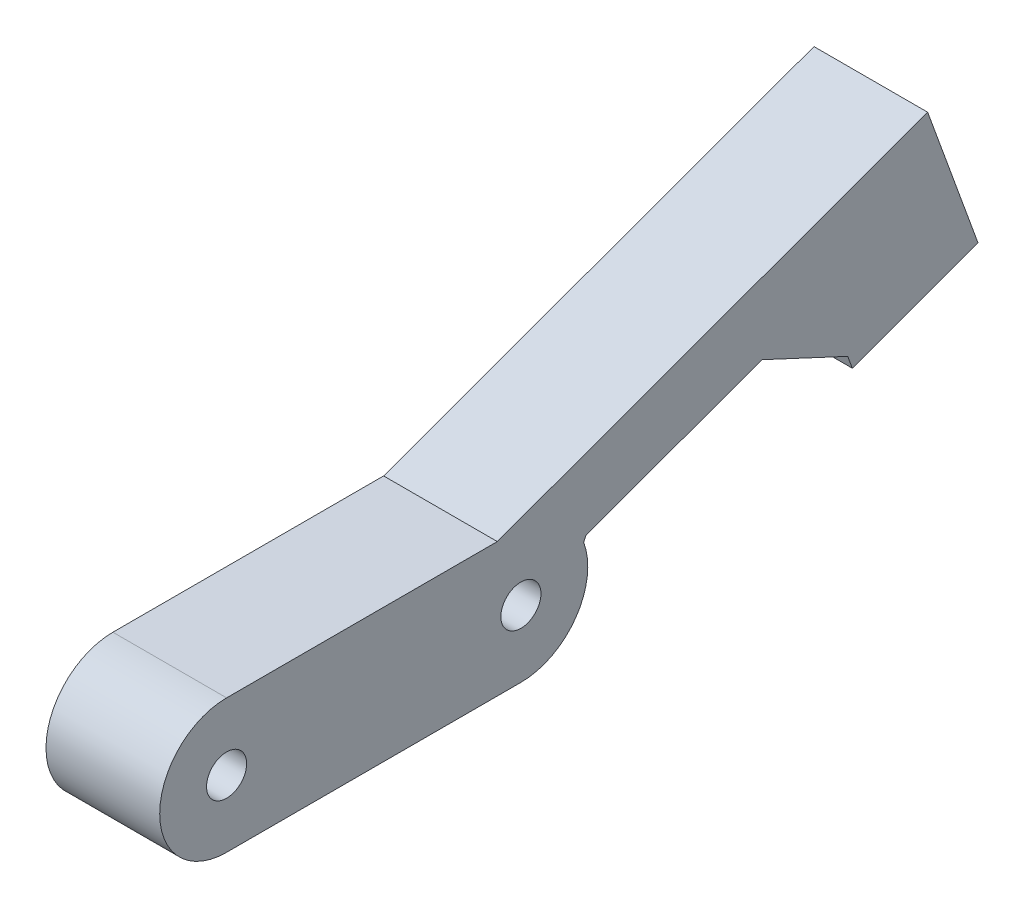
ISO-10303-21;
HEADER;
FILE_DESCRIPTION(('STEP AP214'),'2;1');
FILE_NAME('part.step','',(''),(''),'','','');
FILE_SCHEMA(('AUTOMOTIVE_DESIGN { 1 0 10303 214 1 1 1 1 }'));
ENDSEC;
DATA;
#1=APPLICATION_CONTEXT('core data for automotive mechanical design processes');
#2=APPLICATION_PROTOCOL_DEFINITION('international standard','automotive_design',2000,#1);
#3=PRODUCT_CONTEXT('',#1,'mechanical');
#4=PRODUCT('Part','Part','',(#3));
#5=PRODUCT_RELATED_PRODUCT_CATEGORY('part','',(#4));
#6=PRODUCT_DEFINITION_FORMATION('','',#4);
#7=PRODUCT_DEFINITION_CONTEXT('part definition',#1,'design');
#8=PRODUCT_DEFINITION('design','',#6,#7);
#9=PRODUCT_DEFINITION_SHAPE('','',#8);
#10=(LENGTH_UNIT() NAMED_UNIT(*) SI_UNIT(.MILLI.,.METRE.));
#11=(NAMED_UNIT(*) PLANE_ANGLE_UNIT() SI_UNIT($,.RADIAN.));
#12=(NAMED_UNIT(*) SI_UNIT($,.STERADIAN.) SOLID_ANGLE_UNIT());
#13=UNCERTAINTY_MEASURE_WITH_UNIT(LENGTH_MEASURE(1.E-05),#10,'distance_accuracy_value','');
#14=(GEOMETRIC_REPRESENTATION_CONTEXT(3) GLOBAL_UNCERTAINTY_ASSIGNED_CONTEXT((#13)) GLOBAL_UNIT_ASSIGNED_CONTEXT((#10,
#11,#12)) REPRESENTATION_CONTEXT('',''));
#15=CARTESIAN_POINT('',(0.,0.,0.));
#16=DIRECTION('',(0.,0.,1.));
#17=DIRECTION('',(1.,0.,0.));
#18=AXIS2_PLACEMENT_3D('',#15,#16,#17);
#19=CARTESIAN_POINT('',(8.5,5.,-27.));
#20=DIRECTION('',(-1.,0.,0.));
#21=DIRECTION('',(0.,0.,1.));
#22=AXIS2_PLACEMENT_3D('',#19,#20,#21);
#23=CYLINDRICAL_SURFACE('',#22,5.);
#24=DIRECTION('',(1.,0.,0.));
#25=VECTOR('',#24,1.);
#26=CARTESIAN_POINT('',(0.,6.7210191769148,-31.6944747302218));
#27=LINE('',#26,#25);
#28=CARTESIAN_POINT('',(0.,6.7210191769148,-31.6944747302218));
#29=VERTEX_POINT('',#28);
#30=CARTESIAN_POINT('',(8.5,6.7210191769148,-31.6944747302218));
#31=VERTEX_POINT('',#30);
#32=EDGE_CURVE('E187',#29,#31,#27,.T.);
#33=ORIENTED_EDGE('',*,*,#32,.T.);
#34=CARTESIAN_POINT('',(8.5,5.,-27.));
#35=DIRECTION('',(1.,0.,0.));
#36=DIRECTION('',(0.,0.,-1.));
#37=AXIS2_PLACEMENT_3D('',#34,#35,#36);
#38=CIRCLE('',#37,5.);
#39=CARTESIAN_POINT('',(8.5,0.,-27.));
#40=VERTEX_POINT('',#39);
#41=EDGE_CURVE('E205',#40,#31,#38,.T.);
#42=ORIENTED_EDGE('',*,*,#41,.F.);
#43=DIRECTION('',(-1.,0.,0.));
#44=VECTOR('',#43,1.);
#45=CARTESIAN_POINT('',(8.5,0.,-27.));
#46=LINE('',#45,#44);
#47=CARTESIAN_POINT('',(0.,0.,-27.));
#48=VERTEX_POINT('',#47);
#49=EDGE_CURVE('E213',#40,#48,#46,.T.);
#50=ORIENTED_EDGE('',*,*,#49,.T.);
#51=CARTESIAN_POINT('',(0.,5.,-27.));
#52=DIRECTION('',(1.,0.,0.));
#53=DIRECTION('',(0.,0.,-1.));
#54=AXIS2_PLACEMENT_3D('',#51,#52,#53);
#55=CIRCLE('',#54,5.);
#56=EDGE_CURVE('E217',#48,#29,#55,.T.);
#57=ORIENTED_EDGE('',*,*,#56,.T.);
#58=EDGE_LOOP('',(#33,#42,#50,#57));
#59=FACE_BOUND('',#58,.T.);
#60=ADVANCED_FACE('F37',(#59),#23,.T.);
#61=CARTESIAN_POINT('',(8.5,10.,0.));
#62=DIRECTION('',(0.,1.,0.));
#63=DIRECTION('',(0.,0.,1.));
#64=AXIS2_PLACEMENT_3D('',#61,#62,#63);
#65=PLANE('',#64);
#66=DIRECTION('',(1.,0.,0.));
#67=VECTOR('',#66,1.);
#68=CARTESIAN_POINT('',(0.,10.,-25.2367301929157));
#69=LINE('',#68,#67);
#70=CARTESIAN_POINT('',(0.,10.,-25.2367301929157));
#71=VERTEX_POINT('',#70);
#72=CARTESIAN_POINT('',(8.5,10.,-25.2367301929157));
#73=VERTEX_POINT('',#72);
#74=EDGE_CURVE('E190',#71,#73,#69,.T.);
#75=ORIENTED_EDGE('',*,*,#74,.F.);
#76=DIRECTION('',(0.,0.,-1.));
#77=VECTOR('',#76,1.);
#78=CARTESIAN_POINT('',(0.,10.,0.));
#79=LINE('',#78,#77);
#80=CARTESIAN_POINT('',(0.,10.,-5.));
#81=VERTEX_POINT('',#80);
#82=EDGE_CURVE('E186',#81,#71,#79,.T.);
#83=ORIENTED_EDGE('',*,*,#82,.F.);
#84=DIRECTION('',(-1.,0.,0.));
#85=VECTOR('',#84,1.);
#86=CARTESIAN_POINT('',(8.5,10.,-5.));
#87=LINE('',#86,#85);
#88=CARTESIAN_POINT('',(8.5,10.,-5.));
#89=VERTEX_POINT('',#88);
#90=EDGE_CURVE('E11',#89,#81,#87,.T.);
#91=ORIENTED_EDGE('',*,*,#90,.F.);
#92=DIRECTION('',(0.,0.,-1.));
#93=VECTOR('',#92,1.);
#94=CARTESIAN_POINT('',(8.5,10.,0.));
#95=LINE('',#94,#93);
#96=EDGE_CURVE('E199',#89,#73,#95,.T.);
#97=ORIENTED_EDGE('',*,*,#96,.T.);
#98=EDGE_LOOP('',(#75,#83,#91,#97));
#99=FACE_BOUND('',#98,.T.);
#100=ADVANCED_FACE('F39',(#99),#65,.T.);
#101=CARTESIAN_POINT('',(8.5,5.,-5.));
#102=DIRECTION('',(-1.,0.,0.));
#103=DIRECTION('',(0.,0.,1.));
#104=AXIS2_PLACEMENT_3D('',#101,#102,#103);
#105=CYLINDRICAL_SURFACE('',#104,5.);
#106=CARTESIAN_POINT('',(0.,5.,-5.));
#107=DIRECTION('',(1.,0.,0.));
#108=DIRECTION('',(0.,0.,-1.));
#109=AXIS2_PLACEMENT_3D('',#106,#107,#108);
#110=CIRCLE('',#109,5.);
#111=CARTESIAN_POINT('',(0.,0.,-5.));
#112=VERTEX_POINT('',#111);
#113=EDGE_CURVE('E67',#81,#112,#110,.T.);
#114=ORIENTED_EDGE('',*,*,#113,.T.);
#115=DIRECTION('',(-1.,0.,0.));
#116=VECTOR('',#115,1.);
#117=CARTESIAN_POINT('',(8.5,0.,-5.));
#118=LINE('',#117,#116);
#119=CARTESIAN_POINT('',(8.5,0.,-5.));
#120=VERTEX_POINT('',#119);
#121=EDGE_CURVE('E46',#120,#112,#118,.T.);
#122=ORIENTED_EDGE('',*,*,#121,.F.);
#123=CARTESIAN_POINT('',(8.5,5.,-5.));
#124=DIRECTION('',(1.,0.,0.));
#125=DIRECTION('',(0.,0.,-1.));
#126=AXIS2_PLACEMENT_3D('',#123,#124,#125);
#127=CIRCLE('',#126,5.);
#128=EDGE_CURVE('E201',#89,#120,#127,.T.);
#129=ORIENTED_EDGE('',*,*,#128,.F.);
#130=ORIENTED_EDGE('',*,*,#90,.T.);
#131=EDGE_LOOP('',(#114,#122,#129,#130));
#132=FACE_BOUND('',#131,.T.);
#133=ADVANCED_FACE('F252',(#132),#105,.T.);
#134=CARTESIAN_POINT('',(8.5,0.,0.));
#135=DIRECTION('',(0.,1.,0.));
#136=DIRECTION('',(0.,0.,1.));
#137=AXIS2_PLACEMENT_3D('',#134,#135,#136);
#138=PLANE('',#137);
#139=DIRECTION('',(0.,0.,-1.));
#140=VECTOR('',#139,1.);
#141=CARTESIAN_POINT('',(0.,0.,0.));
#142=LINE('',#141,#140);
#143=EDGE_CURVE('E72',#112,#48,#142,.T.);
#144=ORIENTED_EDGE('',*,*,#143,.T.);
#145=ORIENTED_EDGE('',*,*,#49,.F.);
#146=DIRECTION('',(0.,0.,-1.));
#147=VECTOR('',#146,1.);
#148=CARTESIAN_POINT('',(8.5,0.,0.));
#149=LINE('',#148,#147);
#150=EDGE_CURVE('E54',#120,#40,#149,.T.);
#151=ORIENTED_EDGE('',*,*,#150,.F.);
#152=ORIENTED_EDGE('',*,*,#121,.T.);
#153=EDGE_LOOP('',(#144,#145,#151,#152));
#154=FACE_BOUND('',#153,.T.);
#155=ADVANCED_FACE('F225',(#154),#138,.F.);
#156=CARTESIAN_POINT('',(8.5,5.,-5.));
#157=DIRECTION('',(-1.,0.,0.));
#158=DIRECTION('',(0.,0.,1.));
#159=AXIS2_PLACEMENT_3D('',#156,#157,#158);
#160=CYLINDRICAL_SURFACE('',#159,1.5);
#161=CARTESIAN_POINT('',(8.5,5.,-5.));
#162=DIRECTION('',(1.,0.,0.));
#163=DIRECTION('',(0.,0.,-1.));
#164=AXIS2_PLACEMENT_3D('',#161,#162,#163);
#165=CIRCLE('',#164,1.5);
#166=CARTESIAN_POINT('',(8.5,5.,-6.5));
#167=VERTEX_POINT('',#166);
#168=EDGE_CURVE('E207',#167,#167,#165,.T.);
#169=ORIENTED_EDGE('',*,*,#168,.T.);
#170=EDGE_LOOP('',(#169));
#171=FACE_BOUND('',#170,.T.);
#172=CARTESIAN_POINT('',(0.,5.,-5.));
#173=DIRECTION('',(1.,0.,0.));
#174=DIRECTION('',(0.,0.,-1.));
#175=AXIS2_PLACEMENT_3D('',#172,#173,#174);
#176=CIRCLE('',#175,1.5);
#177=CARTESIAN_POINT('',(0.,5.,-6.5));
#178=VERTEX_POINT('',#177);
#179=EDGE_CURVE('E220',#178,#178,#176,.T.);
#180=ORIENTED_EDGE('',*,*,#179,.F.);
#181=EDGE_LOOP('',(#180));
#182=FACE_BOUND('',#181,.T.);
#183=ADVANCED_FACE('F255',(#171,#182),#160,.F.);
#184=CARTESIAN_POINT('',(8.5,5.,-27.));
#185=DIRECTION('',(-1.,0.,0.));
#186=DIRECTION('',(0.,0.,1.));
#187=AXIS2_PLACEMENT_3D('',#184,#185,#186);
#188=CYLINDRICAL_SURFACE('',#187,1.5);
#189=CARTESIAN_POINT('',(8.5,5.,-27.));
#190=DIRECTION('',(1.,0.,0.));
#191=DIRECTION('',(0.,0.,-1.));
#192=AXIS2_PLACEMENT_3D('',#189,#190,#191);
#193=CIRCLE('',#192,1.5);
#194=CARTESIAN_POINT('',(8.5,5.,-28.5));
#195=VERTEX_POINT('',#194);
#196=EDGE_CURVE('E210',#195,#195,#193,.T.);
#197=ORIENTED_EDGE('',*,*,#196,.T.);
#198=EDGE_LOOP('',(#197));
#199=FACE_BOUND('',#198,.T.);
#200=CARTESIAN_POINT('',(0.,5.,-27.));
#201=DIRECTION('',(1.,0.,0.));
#202=DIRECTION('',(0.,0.,-1.));
#203=AXIS2_PLACEMENT_3D('',#200,#201,#202);
#204=CIRCLE('',#203,1.5);
#205=CARTESIAN_POINT('',(0.,5.,-28.5));
#206=VERTEX_POINT('',#205);
#207=EDGE_CURVE('E202',#206,#206,#204,.T.);
#208=ORIENTED_EDGE('',*,*,#207,.F.);
#209=EDGE_LOOP('',(#208));
#210=FACE_BOUND('',#209,.T.);
#211=ADVANCED_FACE('F273',(#199,#210),#188,.F.);
#212=CARTESIAN_POINT('',(8.5,0.,0.));
#213=DIRECTION('',(1.,0.,0.));
#214=DIRECTION('',(0.,0.,-1.));
#215=AXIS2_PLACEMENT_3D('',#212,#213,#214);
#216=PLANE('',#215);
#217=ORIENTED_EDGE('',*,*,#96,.F.);
#218=ORIENTED_EDGE('',*,*,#128,.T.);
#219=ORIENTED_EDGE('',*,*,#150,.T.);
#220=ORIENTED_EDGE('',*,*,#41,.T.);
#221=DIRECTION('',(0.,-0.906307787036648,0.422618261740703));
#222=VECTOR('',#221,1.);
#223=CARTESIAN_POINT('',(8.5,-10.9392724595665,-23.4593454948798));
#224=LINE('',#223,#222);
#225=CARTESIAN_POINT('',(8.5,7.09260410720914,-31.8677476288731));
#226=VERTEX_POINT('',#225);
#227=EDGE_CURVE('E156',#226,#31,#224,.T.);
#228=ORIENTED_EDGE('',*,*,#227,.F.);
#229=DIRECTION('',(0.,0.342020143325674,-0.939692620785907));
#230=VECTOR('',#229,1.);
#231=CARTESIAN_POINT('',(8.5,-3.97916962683899,-1.44829930126557));
#232=LINE('',#231,#230);
#233=CARTESIAN_POINT('',(8.5,11.8808861137686,-45.0234443198758));
#234=VERTEX_POINT('',#233);
#235=EDGE_CURVE('E171',#226,#234,#232,.T.);
#236=ORIENTED_EDGE('',*,*,#235,.T.);
#237=DIRECTION('',(0.,-0.422618261740699,-0.90630778703665));
#238=VECTOR('',#237,1.);
#239=CARTESIAN_POINT('',(8.5,27.0038659155567,-12.5921094762148));
#240=LINE('',#239,#238);
#241=CARTESIAN_POINT('',(8.5,8.89252372646742,-51.4320081404336));
#242=VERTEX_POINT('',#241);
#243=EDGE_CURVE('E134',#234,#242,#240,.T.);
#244=ORIENTED_EDGE('',*,*,#243,.T.);
#245=DIRECTION('',(0.,-0.939692620785908,-0.34202014332567));
#246=VECTOR('',#245,1.);
#247=CARTESIAN_POINT('',(8.5,17.5701564572357,-48.2736081225398));
#248=LINE('',#247,#246);
#249=CARTESIAN_POINT('',(8.5,7.95283110568152,-51.7740282837593));
#250=VERTEX_POINT('',#249);
#251=EDGE_CURVE('E174',#242,#250,#248,.T.);
#252=ORIENTED_EDGE('',*,*,#251,.T.);
#253=DIRECTION('',(0.,0.34202014332567,-0.939692620785908));
#254=VECTOR('',#253,1.);
#255=CARTESIAN_POINT('',(8.5,-9.61732535155422,-3.5004201612195));
#256=LINE('',#255,#254);
#257=CARTESIAN_POINT('',(8.5,11.3730325389382,-61.1709544916183));
#258=VERTEX_POINT('',#257);
#259=EDGE_CURVE('E177',#250,#258,#256,.T.);
#260=ORIENTED_EDGE('',*,*,#259,.T.);
#261=DIRECTION('',(0.,0.939692620785907,0.342020143325673));
#262=VECTOR('',#261,1.);
#263=CARTESIAN_POINT('',(8.5,20.9903578904926,-57.6705343303987));
#264=LINE('',#263,#262);
#265=CARTESIAN_POINT('',(8.5,21.7096513675832,-57.4087329150359));
#266=VERTEX_POINT('',#265);
#267=EDGE_CURVE('E180',#258,#266,#264,.T.);
#268=ORIENTED_EDGE('',*,*,#267,.T.);
#269=DIRECTION('',(0.,-0.342020143325674,0.939692620785907));
#270=VECTOR('',#269,1.);
#271=CARTESIAN_POINT('',(8.5,0.719293477090533,0.261801415362797));
#272=LINE('',#271,#270);
#273=EDGE_CURVE('E158',#266,#73,#272,.T.);
#274=ORIENTED_EDGE('',*,*,#273,.T.);
#275=EDGE_LOOP('',(#217,#218,#219,#220,#228,#236,#244,#252,#260,#268,#274));
#276=FACE_BOUND('',#275,.T.);
#277=ORIENTED_EDGE('',*,*,#168,.F.);
#278=EDGE_LOOP('',(#277));
#279=FACE_BOUND('',#278,.T.);
#280=ORIENTED_EDGE('',*,*,#196,.F.);
#281=EDGE_LOOP('',(#280));
#282=FACE_BOUND('',#281,.T.);
#283=ADVANCED_FACE('F232',(#276,#279,#282),#216,.T.);
#284=CARTESIAN_POINT('',(0.,0.,0.));
#285=DIRECTION('',(1.,0.,0.));
#286=DIRECTION('',(0.,0.,-1.));
#287=AXIS2_PLACEMENT_3D('',#284,#285,#286);
#288=PLANE('',#287);
#289=ORIENTED_EDGE('',*,*,#82,.T.);
#290=DIRECTION('',(0.,-0.342020143325674,0.939692620785907));
#291=VECTOR('',#290,1.);
#292=CARTESIAN_POINT('',(0.,0.719293477090533,0.261801415362797));
#293=LINE('',#292,#291);
#294=CARTESIAN_POINT('',(0.,21.7096513675832,-57.4087329150359));
#295=VERTEX_POINT('',#294);
#296=EDGE_CURVE('E168',#295,#71,#293,.T.);
#297=ORIENTED_EDGE('',*,*,#296,.F.);
#298=DIRECTION('',(0.,0.939692620785907,0.342020143325673));
#299=VECTOR('',#298,1.);
#300=CARTESIAN_POINT('',(0.,20.9903578904926,-57.6705343303987));
#301=LINE('',#300,#299);
#302=CARTESIAN_POINT('',(0.,11.3730325389382,-61.1709544916183));
#303=VERTEX_POINT('',#302);
#304=EDGE_CURVE('E165',#303,#295,#301,.T.);
#305=ORIENTED_EDGE('',*,*,#304,.F.);
#306=DIRECTION('',(0.,0.34202014332567,-0.939692620785908));
#307=VECTOR('',#306,1.);
#308=CARTESIAN_POINT('',(0.,-9.61732535155422,-3.5004201612195));
#309=LINE('',#308,#307);
#310=CARTESIAN_POINT('',(0.,7.95283110568152,-51.7740282837593));
#311=VERTEX_POINT('',#310);
#312=EDGE_CURVE('E162',#311,#303,#309,.T.);
#313=ORIENTED_EDGE('',*,*,#312,.F.);
#314=DIRECTION('',(0.,-0.939692620785908,-0.34202014332567));
#315=VECTOR('',#314,1.);
#316=CARTESIAN_POINT('',(0.,17.5701564572357,-48.2736081225398));
#317=LINE('',#316,#315);
#318=CARTESIAN_POINT('',(0.,8.89252372646742,-51.4320081404336));
#319=VERTEX_POINT('',#318);
#320=EDGE_CURVE('E151',#319,#311,#317,.T.);
#321=ORIENTED_EDGE('',*,*,#320,.F.);
#322=DIRECTION('',(0.,-0.422618261740699,-0.90630778703665));
#323=VECTOR('',#322,1.);
#324=CARTESIAN_POINT('',(0.,27.0038659155567,-12.5921094762148));
#325=LINE('',#324,#323);
#326=CARTESIAN_POINT('',(0.,11.8808861137686,-45.0234443198758));
#327=VERTEX_POINT('',#326);
#328=EDGE_CURVE('E132',#327,#319,#325,.T.);
#329=ORIENTED_EDGE('',*,*,#328,.F.);
#330=DIRECTION('',(0.,0.342020143325674,-0.939692620785907));
#331=VECTOR('',#330,1.);
#332=CARTESIAN_POINT('',(0.,-3.97916962683899,-1.44829930126557));
#333=LINE('',#332,#331);
#334=CARTESIAN_POINT('',(0.,7.09260410720914,-31.8677476288731));
#335=VERTEX_POINT('',#334);
#336=EDGE_CURVE('E148',#335,#327,#333,.T.);
#337=ORIENTED_EDGE('',*,*,#336,.F.);
#338=DIRECTION('',(0.,-0.906307787036648,0.422618261740703));
#339=VECTOR('',#338,1.);
#340=CARTESIAN_POINT('',(0.,-10.9392724595665,-23.4593454948798));
#341=LINE('',#340,#339);
#342=EDGE_CURVE('E140',#335,#29,#341,.T.);
#343=ORIENTED_EDGE('',*,*,#342,.T.);
#344=ORIENTED_EDGE('',*,*,#56,.F.);
#345=ORIENTED_EDGE('',*,*,#143,.F.);
#346=ORIENTED_EDGE('',*,*,#113,.F.);
#347=EDGE_LOOP('',(#289,#297,#305,#313,#321,#329,#337,#343,#344,#345,#346));
#348=FACE_BOUND('',#347,.T.);
#349=ORIENTED_EDGE('',*,*,#179,.T.);
#350=EDGE_LOOP('',(#349));
#351=FACE_BOUND('',#350,.T.);
#352=ORIENTED_EDGE('',*,*,#207,.T.);
#353=EDGE_LOOP('',(#352));
#354=FACE_BOUND('',#353,.T.);
#355=ADVANCED_FACE('F146',(#348,#351,#354),#288,.F.);
#356=CARTESIAN_POINT('',(0.,-3.97916962683899,-1.44829930126557));
#357=DIRECTION('',(0.,-0.939692620785907,-0.342020143325674));
#358=DIRECTION('',(0.,0.342020143325674,-0.939692620785907));
#359=AXIS2_PLACEMENT_3D('',#356,#357,#358);
#360=PLANE('',#359);
#361=ORIENTED_EDGE('',*,*,#235,.F.);
#362=DIRECTION('',(1.,0.,0.));
#363=VECTOR('',#362,1.);
#364=CARTESIAN_POINT('',(0.,7.09260410720914,-31.8677476288731));
#365=LINE('',#364,#363);
#366=EDGE_CURVE('E154',#335,#226,#365,.T.);
#367=ORIENTED_EDGE('',*,*,#366,.F.);
#368=ORIENTED_EDGE('',*,*,#336,.T.);
#369=DIRECTION('',(1.,0.,0.));
#370=VECTOR('',#369,1.);
#371=CARTESIAN_POINT('',(0.,11.8808861137686,-45.0234443198758));
#372=LINE('',#371,#370);
#373=EDGE_CURVE('E129',#327,#234,#372,.T.);
#374=ORIENTED_EDGE('',*,*,#373,.T.);
#375=EDGE_LOOP('',(#361,#367,#368,#374));
#376=FACE_BOUND('',#375,.T.);
#377=ADVANCED_FACE('F153',(#376),#360,.T.);
#378=CARTESIAN_POINT('',(0.,-10.9392724595665,-23.4593454948798));
#379=DIRECTION('',(0.,0.422618261740703,0.906307787036648));
#380=DIRECTION('',(0.,-0.906307787036648,0.422618261740703));
#381=AXIS2_PLACEMENT_3D('',#378,#379,#380);
#382=PLANE('',#381);
#383=ORIENTED_EDGE('',*,*,#227,.T.);
#384=ORIENTED_EDGE('',*,*,#32,.F.);
#385=ORIENTED_EDGE('',*,*,#342,.F.);
#386=ORIENTED_EDGE('',*,*,#366,.T.);
#387=EDGE_LOOP('',(#383,#384,#385,#386));
#388=FACE_BOUND('',#387,.T.);
#389=ADVANCED_FACE('F235',(#388),#382,.F.);
#390=CARTESIAN_POINT('',(0.,0.719293477090533,0.261801415362797));
#391=DIRECTION('',(0.,0.939692620785906,0.342020143325674));
#392=DIRECTION('',(0.,-0.342020143325674,0.939692620785906));
#393=AXIS2_PLACEMENT_3D('',#390,#391,#392);
#394=PLANE('',#393);
#395=ORIENTED_EDGE('',*,*,#273,.F.);
#396=DIRECTION('',(1.,0.,0.));
#397=VECTOR('',#396,1.);
#398=CARTESIAN_POINT('',(0.,21.7096513675832,-57.4087329150359));
#399=LINE('',#398,#397);
#400=EDGE_CURVE('E192',#295,#266,#399,.T.);
#401=ORIENTED_EDGE('',*,*,#400,.F.);
#402=ORIENTED_EDGE('',*,*,#296,.T.);
#403=ORIENTED_EDGE('',*,*,#74,.T.);
#404=EDGE_LOOP('',(#395,#401,#402,#403));
#405=FACE_BOUND('',#404,.T.);
#406=ADVANCED_FACE('F237',(#405),#394,.T.);
#407=CARTESIAN_POINT('',(0.,20.9903578904926,-57.6705343303987));
#408=DIRECTION('',(0.,0.342020143325673,-0.939692620785907));
#409=DIRECTION('',(0.,0.939692620785907,0.342020143325673));
#410=AXIS2_PLACEMENT_3D('',#407,#408,#409);
#411=PLANE('',#410);
#412=ORIENTED_EDGE('',*,*,#267,.F.);
#413=DIRECTION('',(1.,0.,0.));
#414=VECTOR('',#413,1.);
#415=CARTESIAN_POINT('',(0.,11.3730325389382,-61.1709544916183));
#416=LINE('',#415,#414);
#417=EDGE_CURVE('E194',#303,#258,#416,.T.);
#418=ORIENTED_EDGE('',*,*,#417,.F.);
#419=ORIENTED_EDGE('',*,*,#304,.T.);
#420=ORIENTED_EDGE('',*,*,#400,.T.);
#421=EDGE_LOOP('',(#412,#418,#419,#420));
#422=FACE_BOUND('',#421,.T.);
#423=ADVANCED_FACE('F243',(#422),#411,.T.);
#424=CARTESIAN_POINT('',(0.,-9.61732535155422,-3.5004201612195));
#425=DIRECTION('',(0.,-0.939692620785908,-0.34202014332567));
#426=DIRECTION('',(0.,0.34202014332567,-0.939692620785908));
#427=AXIS2_PLACEMENT_3D('',#424,#425,#426);
#428=PLANE('',#427);
#429=ORIENTED_EDGE('',*,*,#259,.F.);
#430=DIRECTION('',(1.,0.,0.));
#431=VECTOR('',#430,1.);
#432=CARTESIAN_POINT('',(0.,7.95283110568152,-51.7740282837593));
#433=LINE('',#432,#431);
#434=EDGE_CURVE('E196',#311,#250,#433,.T.);
#435=ORIENTED_EDGE('',*,*,#434,.F.);
#436=ORIENTED_EDGE('',*,*,#312,.T.);
#437=ORIENTED_EDGE('',*,*,#417,.T.);
#438=EDGE_LOOP('',(#429,#435,#436,#437));
#439=FACE_BOUND('',#438,.T.);
#440=ADVANCED_FACE('F316',(#439),#428,.T.);
#441=CARTESIAN_POINT('',(0.,17.5701564572357,-48.2736081225398));
#442=DIRECTION('',(0.,-0.34202014332567,0.939692620785908));
#443=DIRECTION('',(0.,-0.939692620785908,-0.34202014332567));
#444=AXIS2_PLACEMENT_3D('',#441,#442,#443);
#445=PLANE('',#444);
#446=ORIENTED_EDGE('',*,*,#251,.F.);
#447=DIRECTION('',(1.,0.,0.));
#448=VECTOR('',#447,1.);
#449=CARTESIAN_POINT('',(0.,8.89252372646742,-51.4320081404336));
#450=LINE('',#449,#448);
#451=EDGE_CURVE('E139',#319,#242,#450,.T.);
#452=ORIENTED_EDGE('',*,*,#451,.F.);
#453=ORIENTED_EDGE('',*,*,#320,.T.);
#454=ORIENTED_EDGE('',*,*,#434,.T.);
#455=EDGE_LOOP('',(#446,#452,#453,#454));
#456=FACE_BOUND('',#455,.T.);
#457=ADVANCED_FACE('F326',(#456),#445,.T.);
#458=CARTESIAN_POINT('',(0.,27.0038659155567,-12.5921094762148));
#459=DIRECTION('',(0.,-0.90630778703665,0.422618261740699));
#460=DIRECTION('',(0.,-0.422618261740699,-0.90630778703665));
#461=AXIS2_PLACEMENT_3D('',#458,#459,#460);
#462=PLANE('',#461);
#463=ORIENTED_EDGE('',*,*,#243,.F.);
#464=ORIENTED_EDGE('',*,*,#373,.F.);
#465=ORIENTED_EDGE('',*,*,#328,.T.);
#466=ORIENTED_EDGE('',*,*,#451,.T.);
#467=EDGE_LOOP('',(#463,#464,#465,#466));
#468=FACE_BOUND('',#467,.T.);
#469=ADVANCED_FACE('F131',(#468),#462,.T.);
#470=CLOSED_SHELL('',(#60,#100,#133,#155,#183,#211,#283,#355,#377,#389,#406,#423,#440,#457,#469));
#471=MANIFOLD_SOLID_BREP('B2',#470);
#472=ADVANCED_BREP_SHAPE_REPRESENTATION('',(#18,#471),#14);
#473=SHAPE_DEFINITION_REPRESENTATION(#9,#472);
ENDSEC;
END-ISO-10303-21;
